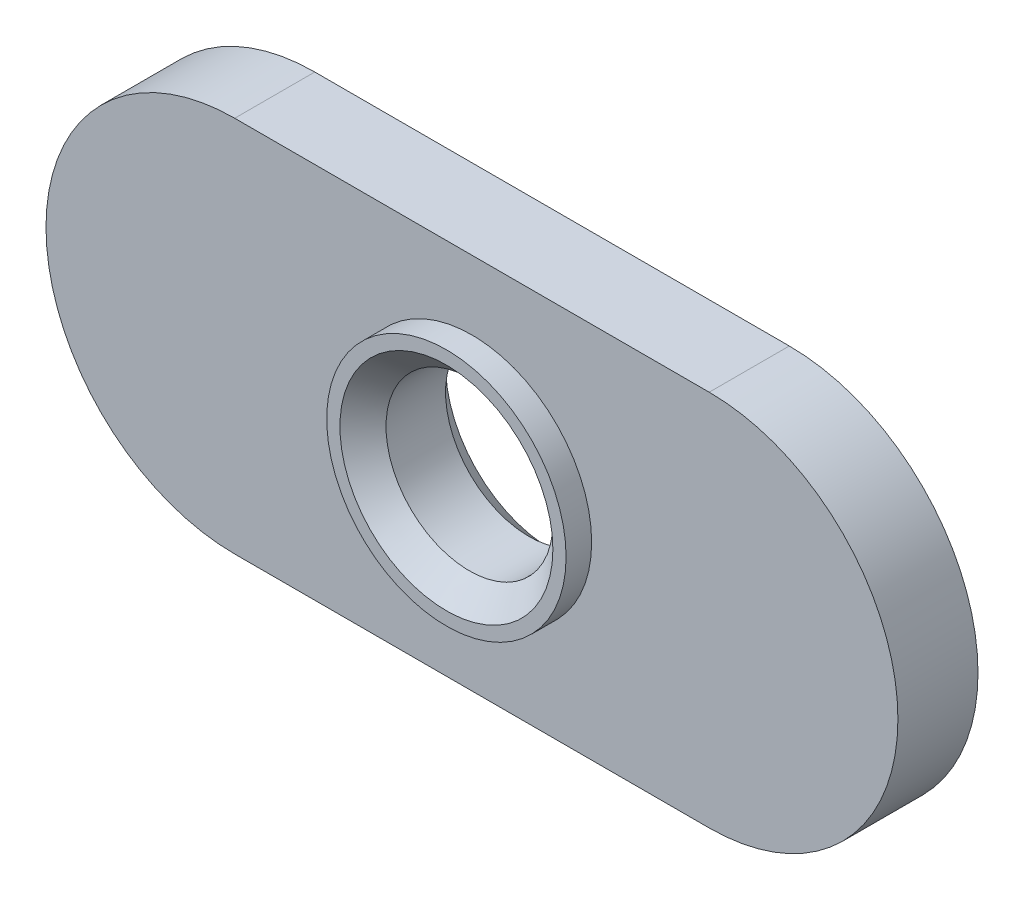
ISO-10303-21;
HEADER;
FILE_DESCRIPTION(('STEP AP214'),'2;1');
FILE_NAME('part.step','',(''),(''),'','','');
FILE_SCHEMA(('AUTOMOTIVE_DESIGN { 1 0 10303 214 1 1 1 1 }'));
ENDSEC;
DATA;
#1=APPLICATION_CONTEXT('core data for automotive mechanical design processes');
#2=APPLICATION_PROTOCOL_DEFINITION('international standard','automotive_design',2000,#1);
#3=PRODUCT_CONTEXT('',#1,'mechanical');
#4=PRODUCT('Part','Part','',(#3));
#5=PRODUCT_RELATED_PRODUCT_CATEGORY('part','',(#4));
#6=PRODUCT_DEFINITION_FORMATION('','',#4);
#7=PRODUCT_DEFINITION_CONTEXT('part definition',#1,'design');
#8=PRODUCT_DEFINITION('design','',#6,#7);
#9=PRODUCT_DEFINITION_SHAPE('','',#8);
#10=(LENGTH_UNIT() NAMED_UNIT(*) SI_UNIT(.MILLI.,.METRE.));
#11=(NAMED_UNIT(*) PLANE_ANGLE_UNIT() SI_UNIT($,.RADIAN.));
#12=(NAMED_UNIT(*) SI_UNIT($,.STERADIAN.) SOLID_ANGLE_UNIT());
#13=UNCERTAINTY_MEASURE_WITH_UNIT(LENGTH_MEASURE(1.E-05),#10,'distance_accuracy_value','');
#14=(GEOMETRIC_REPRESENTATION_CONTEXT(3) GLOBAL_UNCERTAINTY_ASSIGNED_CONTEXT((#13)) GLOBAL_UNIT_ASSIGNED_CONTEXT((#10,
#11,#12)) REPRESENTATION_CONTEXT('',''));
#15=CARTESIAN_POINT('',(0.,0.,0.));
#16=DIRECTION('',(0.,0.,1.));
#17=DIRECTION('',(1.,0.,0.));
#18=AXIS2_PLACEMENT_3D('',#15,#16,#17);
#19=CARTESIAN_POINT('',(-7.0739,0.,-1.1938));
#20=DIRECTION('',(0.,0.,1.));
#21=DIRECTION('',(1.,0.,0.));
#22=AXIS2_PLACEMENT_3D('',#19,#20,#21);
#23=PLANE('',#22);
#24=CARTESIAN_POINT('',(-7.0739,0.,-1.1938));
#25=DIRECTION('',(0.,0.,1.));
#26=DIRECTION('',(1.,0.,0.));
#27=AXIS2_PLACEMENT_3D('',#24,#25,#26);
#28=CIRCLE('',#27,5.6261);
#29=CARTESIAN_POINT('',(-7.0739,5.6261,-1.1938));
#30=VERTEX_POINT('',#29);
#31=CARTESIAN_POINT('',(-7.0739,-5.6261,-1.1938));
#32=VERTEX_POINT('',#31);
#33=EDGE_CURVE('E87',#30,#32,#28,.T.);
#34=ORIENTED_EDGE('',*,*,#33,.F.);
#35=DIRECTION('',(-1.,0.,0.));
#36=VECTOR('',#35,1.);
#37=CARTESIAN_POINT('',(7.0739,5.6261,-1.1938));
#38=LINE('',#37,#36);
#39=CARTESIAN_POINT('',(7.0739,5.6261,-1.1938));
#40=VERTEX_POINT('',#39);
#41=EDGE_CURVE('E100',#40,#30,#38,.T.);
#42=ORIENTED_EDGE('',*,*,#41,.F.);
#43=CARTESIAN_POINT('',(7.0739,0.,-1.1938));
#44=DIRECTION('',(0.,0.,1.));
#45=DIRECTION('',(1.,0.,0.));
#46=AXIS2_PLACEMENT_3D('',#43,#44,#45);
#47=CIRCLE('',#46,5.6261);
#48=CARTESIAN_POINT('',(7.0739,-5.6261,-1.1938));
#49=VERTEX_POINT('',#48);
#50=EDGE_CURVE('E90',#49,#40,#47,.T.);
#51=ORIENTED_EDGE('',*,*,#50,.F.);
#52=DIRECTION('',(1.,0.,0.));
#53=VECTOR('',#52,1.);
#54=CARTESIAN_POINT('',(-7.0739,-5.6261,-1.1938));
#55=LINE('',#54,#53);
#56=EDGE_CURVE('E77',#32,#49,#55,.T.);
#57=ORIENTED_EDGE('',*,*,#56,.F.);
#58=EDGE_LOOP('',(#34,#42,#51,#57));
#59=FACE_BOUND('',#58,.T.);
#60=CARTESIAN_POINT('',(0.,0.,-1.1938));
#61=DIRECTION('',(0.,0.,1.));
#62=DIRECTION('',(1.,0.,0.));
#63=AXIS2_PLACEMENT_3D('',#60,#61,#62);
#64=CIRCLE('',#63,3.175);
#65=CARTESIAN_POINT('',(3.175,0.,-1.1938));
#66=VERTEX_POINT('',#65);
#67=EDGE_CURVE('E140',#66,#66,#64,.T.);
#68=ORIENTED_EDGE('',*,*,#67,.T.);
#69=EDGE_LOOP('',(#68));
#70=FACE_BOUND('',#69,.T.);
#71=ADVANCED_FACE('F33',(#59,#70),#23,.F.);
#72=CARTESIAN_POINT('',(0.,0.,1.9558));
#73=DIRECTION('',(0.,0.,1.));
#74=DIRECTION('',(1.,0.,0.));
#75=AXIS2_PLACEMENT_3D('',#72,#73,#74);
#76=PLANE('',#75);
#77=CARTESIAN_POINT('',(0.,0.,1.9558));
#78=DIRECTION('',(0.,0.,1.));
#79=DIRECTION('',(1.,0.,0.));
#80=AXIS2_PLACEMENT_3D('',#77,#78,#79);
#81=CIRCLE('',#80,3.5687);
#82=CARTESIAN_POINT('',(3.5687,0.,1.9558));
#83=VERTEX_POINT('',#82);
#84=EDGE_CURVE('E95',#83,#83,#81,.T.);
#85=ORIENTED_EDGE('',*,*,#84,.T.);
#86=EDGE_LOOP('',(#85));
#87=FACE_BOUND('',#86,.T.);
#88=CARTESIAN_POINT('',(0.,0.,1.9558));
#89=DIRECTION('',(0.,0.,1.));
#90=DIRECTION('',(1.,0.,0.));
#91=AXIS2_PLACEMENT_3D('',#88,#89,#90);
#92=CIRCLE('',#91,3.175);
#93=CARTESIAN_POINT('',(3.175,0.,1.9558));
#94=VERTEX_POINT('',#93);
#95=EDGE_CURVE('E129',#94,#94,#92,.T.);
#96=ORIENTED_EDGE('',*,*,#95,.F.);
#97=EDGE_LOOP('',(#96));
#98=FACE_BOUND('',#97,.T.);
#99=ADVANCED_FACE('F117',(#87,#98),#76,.T.);
#100=CARTESIAN_POINT('',(-7.0739,0.,1.1938));
#101=DIRECTION('',(0.,0.,1.));
#102=DIRECTION('',(1.,0.,0.));
#103=AXIS2_PLACEMENT_3D('',#100,#101,#102);
#104=PLANE('',#103);
#105=CARTESIAN_POINT('',(-7.0739,0.,1.1938));
#106=DIRECTION('',(0.,0.,1.));
#107=DIRECTION('',(1.,0.,0.));
#108=AXIS2_PLACEMENT_3D('',#105,#106,#107);
#109=CIRCLE('',#108,5.6261);
#110=CARTESIAN_POINT('',(-7.0739,5.6261,1.1938));
#111=VERTEX_POINT('',#110);
#112=CARTESIAN_POINT('',(-7.0739,-5.6261,1.1938));
#113=VERTEX_POINT('',#112);
#114=EDGE_CURVE('E102',#111,#113,#109,.T.);
#115=ORIENTED_EDGE('',*,*,#114,.T.);
#116=DIRECTION('',(1.,0.,0.));
#117=VECTOR('',#116,1.);
#118=CARTESIAN_POINT('',(-7.0739,-5.6261,1.1938));
#119=LINE('',#118,#117);
#120=CARTESIAN_POINT('',(7.0739,-5.6261,1.1938));
#121=VERTEX_POINT('',#120);
#122=EDGE_CURVE('E78',#113,#121,#119,.T.);
#123=ORIENTED_EDGE('',*,*,#122,.T.);
#124=CARTESIAN_POINT('',(7.0739,0.,1.1938));
#125=DIRECTION('',(0.,0.,1.));
#126=DIRECTION('',(1.,0.,0.));
#127=AXIS2_PLACEMENT_3D('',#124,#125,#126);
#128=CIRCLE('',#127,5.6261);
#129=CARTESIAN_POINT('',(7.0739,5.6261,1.1938));
#130=VERTEX_POINT('',#129);
#131=EDGE_CURVE('E54',#121,#130,#128,.T.);
#132=ORIENTED_EDGE('',*,*,#131,.T.);
#133=DIRECTION('',(-1.,0.,0.));
#134=VECTOR('',#133,1.);
#135=CARTESIAN_POINT('',(7.0739,5.6261,1.1938));
#136=LINE('',#135,#134);
#137=EDGE_CURVE('E49',#130,#111,#136,.T.);
#138=ORIENTED_EDGE('',*,*,#137,.T.);
#139=EDGE_LOOP('',(#115,#123,#132,#138));
#140=FACE_BOUND('',#139,.T.);
#141=CARTESIAN_POINT('',(0.,0.,1.1938));
#142=DIRECTION('',(0.,0.,1.));
#143=DIRECTION('',(1.,0.,0.));
#144=AXIS2_PLACEMENT_3D('',#141,#142,#143);
#145=CIRCLE('',#144,3.5687);
#146=CARTESIAN_POINT('',(3.5687,0.,1.1938));
#147=VERTEX_POINT('',#146);
#148=EDGE_CURVE('E37',#147,#147,#145,.F.);
#149=ORIENTED_EDGE('',*,*,#148,.T.);
#150=EDGE_LOOP('',(#149));
#151=FACE_BOUND('',#150,.T.);
#152=ADVANCED_FACE('F114',(#140,#151),#104,.T.);
#153=CARTESIAN_POINT('',(-7.0739,0.,1.1938));
#154=DIRECTION('',(0.,0.,-1.));
#155=DIRECTION('',(-1.,0.,0.));
#156=AXIS2_PLACEMENT_3D('',#153,#154,#155);
#157=CYLINDRICAL_SURFACE('',#156,5.6261);
#158=DIRECTION('',(0.,0.,-1.));
#159=VECTOR('',#158,1.);
#160=CARTESIAN_POINT('',(-7.0739,5.6261,1.1938));
#161=LINE('',#160,#159);
#162=EDGE_CURVE('E92',#111,#30,#161,.T.);
#163=ORIENTED_EDGE('',*,*,#162,.T.);
#164=ORIENTED_EDGE('',*,*,#33,.T.);
#165=DIRECTION('',(0.,0.,-1.));
#166=VECTOR('',#165,1.);
#167=CARTESIAN_POINT('',(-7.0739,-5.6261,1.1938));
#168=LINE('',#167,#166);
#169=EDGE_CURVE('E11',#113,#32,#168,.T.);
#170=ORIENTED_EDGE('',*,*,#169,.F.);
#171=ORIENTED_EDGE('',*,*,#114,.F.);
#172=EDGE_LOOP('',(#163,#164,#170,#171));
#173=FACE_BOUND('',#172,.T.);
#174=ADVANCED_FACE('F35',(#173),#157,.T.);
#175=CARTESIAN_POINT('',(-7.0739,-5.6261,1.1938));
#176=DIRECTION('',(0.,1.,0.));
#177=DIRECTION('',(0.,0.,1.));
#178=AXIS2_PLACEMENT_3D('',#175,#176,#177);
#179=PLANE('',#178);
#180=ORIENTED_EDGE('',*,*,#169,.T.);
#181=ORIENTED_EDGE('',*,*,#56,.T.);
#182=DIRECTION('',(0.,0.,-1.));
#183=VECTOR('',#182,1.);
#184=CARTESIAN_POINT('',(7.0739,-5.6261,1.1938));
#185=LINE('',#184,#183);
#186=EDGE_CURVE('E42',#121,#49,#185,.T.);
#187=ORIENTED_EDGE('',*,*,#186,.F.);
#188=ORIENTED_EDGE('',*,*,#122,.F.);
#189=EDGE_LOOP('',(#180,#181,#187,#188));
#190=FACE_BOUND('',#189,.T.);
#191=ADVANCED_FACE('F75',(#190),#179,.F.);
#192=CARTESIAN_POINT('',(7.0739,0.,1.1938));
#193=DIRECTION('',(0.,0.,-1.));
#194=DIRECTION('',(-1.,0.,0.));
#195=AXIS2_PLACEMENT_3D('',#192,#193,#194);
#196=CYLINDRICAL_SURFACE('',#195,5.6261);
#197=ORIENTED_EDGE('',*,*,#186,.T.);
#198=ORIENTED_EDGE('',*,*,#50,.T.);
#199=DIRECTION('',(0.,0.,-1.));
#200=VECTOR('',#199,1.);
#201=CARTESIAN_POINT('',(7.0739,5.6261,1.1938));
#202=LINE('',#201,#200);
#203=EDGE_CURVE('E108',#130,#40,#202,.T.);
#204=ORIENTED_EDGE('',*,*,#203,.F.);
#205=ORIENTED_EDGE('',*,*,#131,.F.);
#206=EDGE_LOOP('',(#197,#198,#204,#205));
#207=FACE_BOUND('',#206,.T.);
#208=ADVANCED_FACE('F111',(#207),#196,.T.);
#209=CARTESIAN_POINT('',(7.0739,5.6261,1.1938));
#210=DIRECTION('',(0.,-1.,0.));
#211=DIRECTION('',(0.,0.,-1.));
#212=AXIS2_PLACEMENT_3D('',#209,#210,#211);
#213=PLANE('',#212);
#214=ORIENTED_EDGE('',*,*,#203,.T.);
#215=ORIENTED_EDGE('',*,*,#41,.T.);
#216=ORIENTED_EDGE('',*,*,#162,.F.);
#217=ORIENTED_EDGE('',*,*,#137,.F.);
#218=EDGE_LOOP('',(#214,#215,#216,#217));
#219=FACE_BOUND('',#218,.T.);
#220=ADVANCED_FACE('F113',(#219),#213,.F.);
#221=CARTESIAN_POINT('',(0.,0.,1.9558));
#222=DIRECTION('',(0.,0.,-1.));
#223=DIRECTION('',(-1.,0.,0.));
#224=AXIS2_PLACEMENT_3D('',#221,#222,#223);
#225=CYLINDRICAL_SURFACE('',#224,3.5687);
#226=ORIENTED_EDGE('',*,*,#148,.F.);
#227=EDGE_LOOP('',(#226));
#228=FACE_BOUND('',#227,.T.);
#229=ORIENTED_EDGE('',*,*,#84,.F.);
#230=EDGE_LOOP('',(#229));
#231=FACE_BOUND('',#230,.T.);
#232=ADVANCED_FACE('F121',(#228,#231),#225,.T.);
#233=CARTESIAN_POINT('',(0.,0.,1.26873));
#234=DIRECTION('',(0.,0.,1.));
#235=DIRECTION('',(1.,0.,0.));
#236=AXIS2_PLACEMENT_3D('',#233,#234,#235);
#237=CONICAL_SURFACE('',#236,2.48793,0.785398163397448);
#238=ORIENTED_EDGE('',*,*,#95,.T.);
#239=EDGE_LOOP('',(#238));
#240=FACE_BOUND('',#239,.T.);
#241=CARTESIAN_POINT('',(0.,0.,1.26873));
#242=DIRECTION('',(0.,0.,1.));
#243=DIRECTION('',(1.,0.,0.));
#244=AXIS2_PLACEMENT_3D('',#241,#242,#243);
#245=CIRCLE('',#244,2.48793);
#246=CARTESIAN_POINT('',(2.48793,0.,1.26873));
#247=VERTEX_POINT('',#246);
#248=EDGE_CURVE('E131',#247,#247,#245,.T.);
#249=ORIENTED_EDGE('',*,*,#248,.F.);
#250=EDGE_LOOP('',(#249));
#251=FACE_BOUND('',#250,.T.);
#252=ADVANCED_FACE('F124',(#240,#251),#237,.F.);
#253=CARTESIAN_POINT('',(0.,0.,-1.1938));
#254=DIRECTION('',(0.,0.,1.));
#255=DIRECTION('',(1.,0.,0.));
#256=AXIS2_PLACEMENT_3D('',#253,#254,#255);
#257=CYLINDRICAL_SURFACE('',#256,2.48793);
#258=ORIENTED_EDGE('',*,*,#248,.T.);
#259=EDGE_LOOP('',(#258));
#260=FACE_BOUND('',#259,.T.);
#261=CARTESIAN_POINT('',(0.,0.,-0.50673));
#262=DIRECTION('',(0.,0.,1.));
#263=DIRECTION('',(1.,0.,0.));
#264=AXIS2_PLACEMENT_3D('',#261,#262,#263);
#265=CIRCLE('',#264,2.48793);
#266=CARTESIAN_POINT('',(2.48793,0.,-0.50673));
#267=VERTEX_POINT('',#266);
#268=EDGE_CURVE('E135',#267,#267,#265,.T.);
#269=ORIENTED_EDGE('',*,*,#268,.F.);
#270=EDGE_LOOP('',(#269));
#271=FACE_BOUND('',#270,.T.);
#272=ADVANCED_FACE('F146',(#260,#271),#257,.F.);
#273=CARTESIAN_POINT('',(0.,0.,-1.1938));
#274=DIRECTION('',(0.,0.,-1.));
#275=DIRECTION('',(-1.,0.,0.));
#276=AXIS2_PLACEMENT_3D('',#273,#274,#275);
#277=CONICAL_SURFACE('',#276,3.175,0.785398163397448);
#278=ORIENTED_EDGE('',*,*,#268,.T.);
#279=EDGE_LOOP('',(#278));
#280=FACE_BOUND('',#279,.T.);
#281=ORIENTED_EDGE('',*,*,#67,.F.);
#282=EDGE_LOOP('',(#281));
#283=FACE_BOUND('',#282,.T.);
#284=ADVANCED_FACE('F144',(#280,#283),#277,.F.);
#285=CLOSED_SHELL('',(#71,#99,#152,#174,#191,#208,#220,#232,#252,#272,#284));
#286=MANIFOLD_SOLID_BREP('B2',#285);
#287=ADVANCED_BREP_SHAPE_REPRESENTATION('',(#18,#286),#14);
#288=SHAPE_DEFINITION_REPRESENTATION(#9,#287);
ENDSEC;
END-ISO-10303-21;
